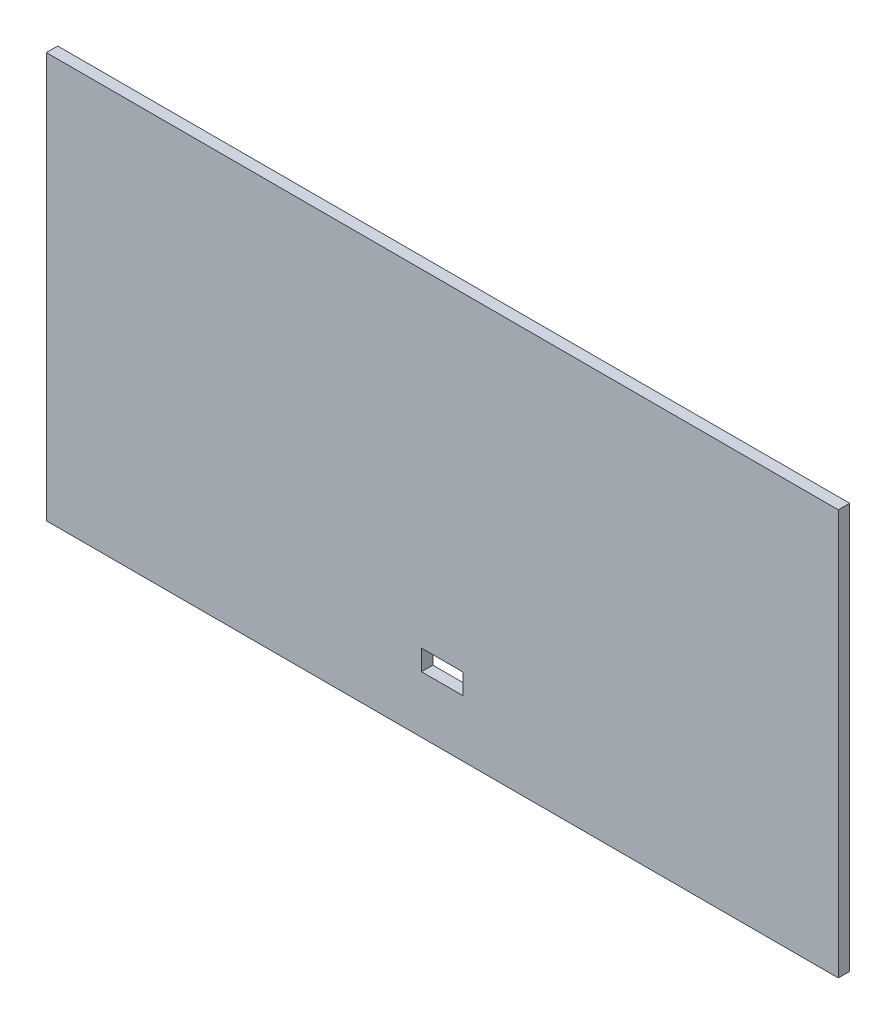
ISO-10303-21;
HEADER;
FILE_DESCRIPTION(('STEP AP214'),'2;1');
FILE_NAME('part.step','',(''),(''),'','','');
FILE_SCHEMA(('AUTOMOTIVE_DESIGN { 1 0 10303 214 1 1 1 1 }'));
ENDSEC;
DATA;
#1=APPLICATION_CONTEXT('core data for automotive mechanical design processes');
#2=APPLICATION_PROTOCOL_DEFINITION('international standard','automotive_design',2000,#1);
#3=PRODUCT_CONTEXT('',#1,'mechanical');
#4=PRODUCT('Part','Part','',(#3));
#5=PRODUCT_RELATED_PRODUCT_CATEGORY('part','',(#4));
#6=PRODUCT_DEFINITION_FORMATION('','',#4);
#7=PRODUCT_DEFINITION_CONTEXT('part definition',#1,'design');
#8=PRODUCT_DEFINITION('design','',#6,#7);
#9=PRODUCT_DEFINITION_SHAPE('','',#8);
#10=(LENGTH_UNIT() NAMED_UNIT(*) SI_UNIT(.MILLI.,.METRE.));
#11=(NAMED_UNIT(*) PLANE_ANGLE_UNIT() SI_UNIT($,.RADIAN.));
#12=(NAMED_UNIT(*) SI_UNIT($,.STERADIAN.) SOLID_ANGLE_UNIT());
#13=UNCERTAINTY_MEASURE_WITH_UNIT(LENGTH_MEASURE(1.E-05),#10,'distance_accuracy_value','');
#14=(GEOMETRIC_REPRESENTATION_CONTEXT(3) GLOBAL_UNCERTAINTY_ASSIGNED_CONTEXT((#13)) GLOBAL_UNIT_ASSIGNED_CONTEXT((#10,
#11,#12)) REPRESENTATION_CONTEXT('',''));
#15=CARTESIAN_POINT('',(0.,0.,0.));
#16=DIRECTION('',(0.,0.,1.));
#17=DIRECTION('',(1.,0.,0.));
#18=AXIS2_PLACEMENT_3D('',#15,#16,#17);
#19=CARTESIAN_POINT('',(0.,0.,3.));
#20=DIRECTION('',(0.,0.,-1.));
#21=DIRECTION('',(-1.,0.,0.));
#22=AXIS2_PLACEMENT_3D('',#19,#20,#21);
#23=PLANE('',#22);
#24=DIRECTION('',(0.,1.,0.));
#25=VECTOR('',#24,1.);
#26=CARTESIAN_POINT('',(104.5,-53.5,3.));
#27=LINE('',#26,#25);
#28=CARTESIAN_POINT('',(104.5,-53.5,3.));
#29=VERTEX_POINT('',#28);
#30=CARTESIAN_POINT('',(104.5,53.5,3.));
#31=VERTEX_POINT('',#30);
#32=EDGE_CURVE('E157',#29,#31,#27,.T.);
#33=ORIENTED_EDGE('',*,*,#32,.T.);
#34=DIRECTION('',(-1.,0.,0.));
#35=VECTOR('',#34,1.);
#36=CARTESIAN_POINT('',(-104.5,53.5,3.));
#37=LINE('',#36,#35);
#38=CARTESIAN_POINT('',(-104.5,53.5,3.));
#39=VERTEX_POINT('',#38);
#40=EDGE_CURVE('E161',#31,#39,#37,.T.);
#41=ORIENTED_EDGE('',*,*,#40,.T.);
#42=DIRECTION('',(0.,-1.,0.));
#43=VECTOR('',#42,1.);
#44=CARTESIAN_POINT('',(-104.5,-53.5,3.));
#45=LINE('',#44,#43);
#46=CARTESIAN_POINT('',(-104.5,-53.5,3.));
#47=VERTEX_POINT('',#46);
#48=EDGE_CURVE('E165',#39,#47,#45,.T.);
#49=ORIENTED_EDGE('',*,*,#48,.T.);
#50=DIRECTION('',(1.,0.,0.));
#51=VECTOR('',#50,1.);
#52=CARTESIAN_POINT('',(-104.5,-53.5,3.));
#53=LINE('',#52,#51);
#54=EDGE_CURVE('E168',#47,#29,#53,.T.);
#55=ORIENTED_EDGE('',*,*,#54,.T.);
#56=EDGE_LOOP('',(#33,#41,#49,#55));
#57=FACE_BOUND('',#56,.T.);
#58=DIRECTION('',(0.,-1.,0.));
#59=VECTOR('',#58,1.);
#60=CARTESIAN_POINT('',(-5.5,-33.1,3.));
#61=LINE('',#60,#59);
#62=CARTESIAN_POINT('',(-5.5,-33.1,3.));
#63=VERTEX_POINT('',#62);
#64=CARTESIAN_POINT('',(-5.5,-38.5,3.));
#65=VERTEX_POINT('',#64);
#66=EDGE_CURVE('E109',#63,#65,#61,.T.);
#67=ORIENTED_EDGE('',*,*,#66,.F.);
#68=DIRECTION('',(-1.,0.,0.));
#69=VECTOR('',#68,1.);
#70=CARTESIAN_POINT('',(-5.5,-33.1,3.));
#71=LINE('',#70,#69);
#72=CARTESIAN_POINT('',(5.5,-33.1,3.));
#73=VERTEX_POINT('',#72);
#74=EDGE_CURVE('E135',#73,#63,#71,.T.);
#75=ORIENTED_EDGE('',*,*,#74,.F.);
#76=DIRECTION('',(0.,1.,0.));
#77=VECTOR('',#76,1.);
#78=CARTESIAN_POINT('',(5.5,-33.1,3.));
#79=LINE('',#78,#77);
#80=CARTESIAN_POINT('',(5.5,-38.5,3.));
#81=VERTEX_POINT('',#80);
#82=EDGE_CURVE('E131',#81,#73,#79,.T.);
#83=ORIENTED_EDGE('',*,*,#82,.F.);
#84=DIRECTION('',(1.,0.,0.));
#85=VECTOR('',#84,1.);
#86=CARTESIAN_POINT('',(-5.5,-38.5,3.));
#87=LINE('',#86,#85);
#88=EDGE_CURVE('E118',#65,#81,#87,.T.);
#89=ORIENTED_EDGE('',*,*,#88,.F.);
#90=EDGE_LOOP('',(#67,#75,#83,#89));
#91=FACE_BOUND('',#90,.T.);
#92=ADVANCED_FACE('F43',(#57,#91),#23,.F.);
#93=CARTESIAN_POINT('',(0.,0.,0.));
#94=DIRECTION('',(0.,0.,-1.));
#95=DIRECTION('',(-1.,0.,0.));
#96=AXIS2_PLACEMENT_3D('',#93,#94,#95);
#97=PLANE('',#96);
#98=DIRECTION('',(0.,1.,0.));
#99=VECTOR('',#98,1.);
#100=CARTESIAN_POINT('',(104.5,-53.5,0.));
#101=LINE('',#100,#99);
#102=CARTESIAN_POINT('',(104.5,-53.5,0.));
#103=VERTEX_POINT('',#102);
#104=CARTESIAN_POINT('',(104.5,53.5,0.));
#105=VERTEX_POINT('',#104);
#106=EDGE_CURVE('E127',#103,#105,#101,.T.);
#107=ORIENTED_EDGE('',*,*,#106,.F.);
#108=DIRECTION('',(1.,0.,0.));
#109=VECTOR('',#108,1.);
#110=CARTESIAN_POINT('',(-104.5,-53.5,0.));
#111=LINE('',#110,#109);
#112=CARTESIAN_POINT('',(-104.5,-53.5,0.));
#113=VERTEX_POINT('',#112);
#114=EDGE_CURVE('E162',#113,#103,#111,.T.);
#115=ORIENTED_EDGE('',*,*,#114,.F.);
#116=DIRECTION('',(0.,-1.,0.));
#117=VECTOR('',#116,1.);
#118=CARTESIAN_POINT('',(-104.5,-53.5,0.));
#119=LINE('',#118,#117);
#120=CARTESIAN_POINT('',(-104.5,53.5,0.));
#121=VERTEX_POINT('',#120);
#122=EDGE_CURVE('E178',#121,#113,#119,.T.);
#123=ORIENTED_EDGE('',*,*,#122,.F.);
#124=DIRECTION('',(-1.,0.,0.));
#125=VECTOR('',#124,1.);
#126=CARTESIAN_POINT('',(-104.5,53.5,0.));
#127=LINE('',#126,#125);
#128=EDGE_CURVE('E175',#105,#121,#127,.T.);
#129=ORIENTED_EDGE('',*,*,#128,.F.);
#130=EDGE_LOOP('',(#107,#115,#123,#129));
#131=FACE_BOUND('',#130,.T.);
#132=DIRECTION('',(-1.,0.,0.));
#133=VECTOR('',#132,1.);
#134=CARTESIAN_POINT('',(-5.5,-33.1,0.));
#135=LINE('',#134,#133);
#136=CARTESIAN_POINT('',(5.5,-33.1,0.));
#137=VERTEX_POINT('',#136);
#138=CARTESIAN_POINT('',(-5.5,-33.1,0.));
#139=VERTEX_POINT('',#138);
#140=EDGE_CURVE('E119',#137,#139,#135,.T.);
#141=ORIENTED_EDGE('',*,*,#140,.T.);
#142=DIRECTION('',(0.,-1.,0.));
#143=VECTOR('',#142,1.);
#144=CARTESIAN_POINT('',(-5.5,-33.1,0.));
#145=LINE('',#144,#143);
#146=CARTESIAN_POINT('',(-5.5,-38.5,0.));
#147=VERTEX_POINT('',#146);
#148=EDGE_CURVE('E67',#139,#147,#145,.T.);
#149=ORIENTED_EDGE('',*,*,#148,.T.);
#150=DIRECTION('',(1.,0.,0.));
#151=VECTOR('',#150,1.);
#152=CARTESIAN_POINT('',(-5.5,-38.5,0.));
#153=LINE('',#152,#151);
#154=CARTESIAN_POINT('',(5.5,-38.5,0.));
#155=VERTEX_POINT('',#154);
#156=EDGE_CURVE('E125',#147,#155,#153,.T.);
#157=ORIENTED_EDGE('',*,*,#156,.T.);
#158=DIRECTION('',(0.,1.,0.));
#159=VECTOR('',#158,1.);
#160=CARTESIAN_POINT('',(5.5,-33.1,0.));
#161=LINE('',#160,#159);
#162=EDGE_CURVE('E144',#155,#137,#161,.T.);
#163=ORIENTED_EDGE('',*,*,#162,.T.);
#164=EDGE_LOOP('',(#141,#149,#157,#163));
#165=FACE_BOUND('',#164,.T.);
#166=ADVANCED_FACE('F201',(#131,#165),#97,.T.);
#167=CARTESIAN_POINT('',(104.5,-53.5,3.));
#168=DIRECTION('',(-1.,0.,0.));
#169=DIRECTION('',(0.,0.,1.));
#170=AXIS2_PLACEMENT_3D('',#167,#168,#169);
#171=PLANE('',#170);
#172=ORIENTED_EDGE('',*,*,#106,.T.);
#173=DIRECTION('',(0.,0.,-1.));
#174=VECTOR('',#173,1.);
#175=CARTESIAN_POINT('',(104.5,53.5,3.));
#176=LINE('',#175,#174);
#177=EDGE_CURVE('E11',#31,#105,#176,.T.);
#178=ORIENTED_EDGE('',*,*,#177,.F.);
#179=ORIENTED_EDGE('',*,*,#32,.F.);
#180=DIRECTION('',(0.,0.,-1.));
#181=VECTOR('',#180,1.);
#182=CARTESIAN_POINT('',(104.5,-53.5,3.));
#183=LINE('',#182,#181);
#184=EDGE_CURVE('E171',#29,#103,#183,.T.);
#185=ORIENTED_EDGE('',*,*,#184,.T.);
#186=EDGE_LOOP('',(#172,#178,#179,#185));
#187=FACE_BOUND('',#186,.T.);
#188=ADVANCED_FACE('F45',(#187),#171,.F.);
#189=CARTESIAN_POINT('',(-104.5,53.5,3.));
#190=DIRECTION('',(0.,-1.,0.));
#191=DIRECTION('',(0.,0.,-1.));
#192=AXIS2_PLACEMENT_3D('',#189,#190,#191);
#193=PLANE('',#192);
#194=ORIENTED_EDGE('',*,*,#128,.T.);
#195=DIRECTION('',(0.,0.,-1.));
#196=VECTOR('',#195,1.);
#197=CARTESIAN_POINT('',(-104.5,53.5,3.));
#198=LINE('',#197,#196);
#199=EDGE_CURVE('E52',#39,#121,#198,.T.);
#200=ORIENTED_EDGE('',*,*,#199,.F.);
#201=ORIENTED_EDGE('',*,*,#40,.F.);
#202=ORIENTED_EDGE('',*,*,#177,.T.);
#203=EDGE_LOOP('',(#194,#200,#201,#202));
#204=FACE_BOUND('',#203,.T.);
#205=ADVANCED_FACE('F211',(#204),#193,.F.);
#206=CARTESIAN_POINT('',(-104.5,-53.5,3.));
#207=DIRECTION('',(1.,0.,0.));
#208=DIRECTION('',(0.,0.,-1.));
#209=AXIS2_PLACEMENT_3D('',#206,#207,#208);
#210=PLANE('',#209);
#211=ORIENTED_EDGE('',*,*,#122,.T.);
#212=DIRECTION('',(0.,0.,-1.));
#213=VECTOR('',#212,1.);
#214=CARTESIAN_POINT('',(-104.5,-53.5,3.));
#215=LINE('',#214,#213);
#216=EDGE_CURVE('E186',#47,#113,#215,.T.);
#217=ORIENTED_EDGE('',*,*,#216,.F.);
#218=ORIENTED_EDGE('',*,*,#48,.F.);
#219=ORIENTED_EDGE('',*,*,#199,.T.);
#220=EDGE_LOOP('',(#211,#217,#218,#219));
#221=FACE_BOUND('',#220,.T.);
#222=ADVANCED_FACE('F195',(#221),#210,.F.);
#223=CARTESIAN_POINT('',(-104.5,-53.5,3.));
#224=DIRECTION('',(0.,1.,0.));
#225=DIRECTION('',(0.,0.,1.));
#226=AXIS2_PLACEMENT_3D('',#223,#224,#225);
#227=PLANE('',#226);
#228=ORIENTED_EDGE('',*,*,#114,.T.);
#229=ORIENTED_EDGE('',*,*,#184,.F.);
#230=ORIENTED_EDGE('',*,*,#54,.F.);
#231=ORIENTED_EDGE('',*,*,#216,.T.);
#232=EDGE_LOOP('',(#228,#229,#230,#231));
#233=FACE_BOUND('',#232,.T.);
#234=ADVANCED_FACE('F205',(#233),#227,.F.);
#235=CARTESIAN_POINT('',(-5.5,-33.1,3.));
#236=DIRECTION('',(1.,0.,0.));
#237=DIRECTION('',(0.,1.,0.));
#238=AXIS2_PLACEMENT_3D('',#235,#236,#237);
#239=PLANE('',#238);
#240=ORIENTED_EDGE('',*,*,#148,.F.);
#241=DIRECTION('',(0.,0.,-1.));
#242=VECTOR('',#241,1.);
#243=CARTESIAN_POINT('',(-5.5,-33.1,3.));
#244=LINE('',#243,#242);
#245=EDGE_CURVE('E113',#63,#139,#244,.T.);
#246=ORIENTED_EDGE('',*,*,#245,.F.);
#247=ORIENTED_EDGE('',*,*,#66,.T.);
#248=DIRECTION('',(0.,0.,-1.));
#249=VECTOR('',#248,1.);
#250=CARTESIAN_POINT('',(-5.5,-38.5,3.));
#251=LINE('',#250,#249);
#252=EDGE_CURVE('E112',#65,#147,#251,.T.);
#253=ORIENTED_EDGE('',*,*,#252,.T.);
#254=EDGE_LOOP('',(#240,#246,#247,#253));
#255=FACE_BOUND('',#254,.T.);
#256=ADVANCED_FACE('F111',(#255),#239,.T.);
#257=CARTESIAN_POINT('',(-5.5,-38.5,3.));
#258=DIRECTION('',(0.,1.,0.));
#259=DIRECTION('',(0.,0.,1.));
#260=AXIS2_PLACEMENT_3D('',#257,#258,#259);
#261=PLANE('',#260);
#262=ORIENTED_EDGE('',*,*,#156,.F.);
#263=ORIENTED_EDGE('',*,*,#252,.F.);
#264=ORIENTED_EDGE('',*,*,#88,.T.);
#265=DIRECTION('',(0.,0.,-1.));
#266=VECTOR('',#265,1.);
#267=CARTESIAN_POINT('',(5.5,-38.5,3.));
#268=LINE('',#267,#266);
#269=EDGE_CURVE('E128',#81,#155,#268,.T.);
#270=ORIENTED_EDGE('',*,*,#269,.T.);
#271=EDGE_LOOP('',(#262,#263,#264,#270));
#272=FACE_BOUND('',#271,.T.);
#273=ADVANCED_FACE('F122',(#272),#261,.T.);
#274=CARTESIAN_POINT('',(5.5,-33.1,3.));
#275=DIRECTION('',(-1.,0.,0.));
#276=DIRECTION('',(0.,-1.,0.));
#277=AXIS2_PLACEMENT_3D('',#274,#275,#276);
#278=PLANE('',#277);
#279=ORIENTED_EDGE('',*,*,#162,.F.);
#280=ORIENTED_EDGE('',*,*,#269,.F.);
#281=ORIENTED_EDGE('',*,*,#82,.T.);
#282=DIRECTION('',(0.,0.,-1.));
#283=VECTOR('',#282,1.);
#284=CARTESIAN_POINT('',(5.5,-33.1,3.));
#285=LINE('',#284,#283);
#286=EDGE_CURVE('E59',#73,#137,#285,.T.);
#287=ORIENTED_EDGE('',*,*,#286,.T.);
#288=EDGE_LOOP('',(#279,#280,#281,#287));
#289=FACE_BOUND('',#288,.T.);
#290=ADVANCED_FACE('F234',(#289),#278,.T.);
#291=CARTESIAN_POINT('',(-5.5,-33.1,3.));
#292=DIRECTION('',(0.,-1.,0.));
#293=DIRECTION('',(0.,0.,-1.));
#294=AXIS2_PLACEMENT_3D('',#291,#292,#293);
#295=PLANE('',#294);
#296=ORIENTED_EDGE('',*,*,#140,.F.);
#297=ORIENTED_EDGE('',*,*,#286,.F.);
#298=ORIENTED_EDGE('',*,*,#74,.T.);
#299=ORIENTED_EDGE('',*,*,#245,.T.);
#300=EDGE_LOOP('',(#296,#297,#298,#299));
#301=FACE_BOUND('',#300,.T.);
#302=ADVANCED_FACE('F238',(#301),#295,.T.);
#303=CLOSED_SHELL('',(#92,#166,#188,#205,#222,#234,#256,#273,#290,#302));
#304=MANIFOLD_SOLID_BREP('B2',#303);
#305=ADVANCED_BREP_SHAPE_REPRESENTATION('',(#18,#304),#14);
#306=SHAPE_DEFINITION_REPRESENTATION(#9,#305);
ENDSEC;
END-ISO-10303-21;
